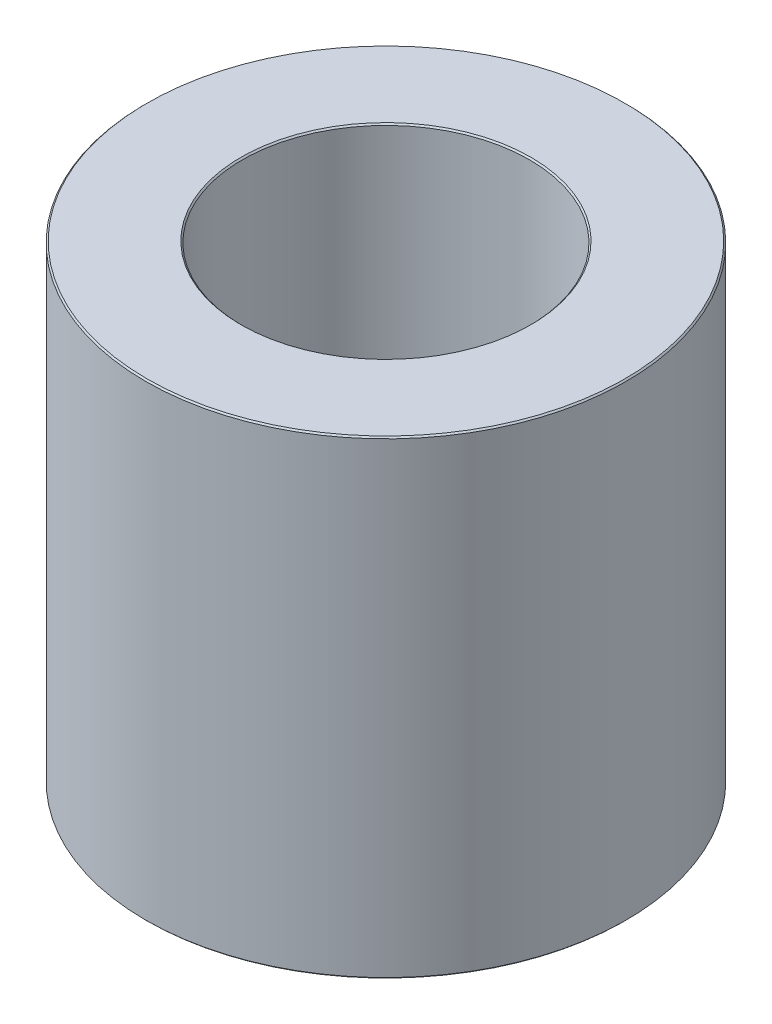
ISO-10303-21;
HEADER;
FILE_DESCRIPTION(('STEP AP214'),'2;1');
FILE_NAME('part.step','',(''),(''),'','','');
FILE_SCHEMA(('AUTOMOTIVE_DESIGN { 1 0 10303 214 1 1 1 1 }'));
ENDSEC;
DATA;
#1=APPLICATION_CONTEXT('core data for automotive mechanical design processes');
#2=APPLICATION_PROTOCOL_DEFINITION('international standard','automotive_design',2000,#1);
#3=PRODUCT_CONTEXT('',#1,'mechanical');
#4=PRODUCT('Part','Part','',(#3));
#5=PRODUCT_RELATED_PRODUCT_CATEGORY('part','',(#4));
#6=PRODUCT_DEFINITION_FORMATION('','',#4);
#7=PRODUCT_DEFINITION_CONTEXT('part definition',#1,'design');
#8=PRODUCT_DEFINITION('design','',#6,#7);
#9=PRODUCT_DEFINITION_SHAPE('','',#8);
#10=(LENGTH_UNIT() NAMED_UNIT(*) SI_UNIT(.MILLI.,.METRE.));
#11=(NAMED_UNIT(*) PLANE_ANGLE_UNIT() SI_UNIT($,.RADIAN.));
#12=(NAMED_UNIT(*) SI_UNIT($,.STERADIAN.) SOLID_ANGLE_UNIT());
#13=UNCERTAINTY_MEASURE_WITH_UNIT(LENGTH_MEASURE(1.E-05),#10,'distance_accuracy_value','');
#14=(GEOMETRIC_REPRESENTATION_CONTEXT(3) GLOBAL_UNCERTAINTY_ASSIGNED_CONTEXT((#13)) GLOBAL_UNIT_ASSIGNED_CONTEXT((#10,
#11,#12)) REPRESENTATION_CONTEXT('',''));
#15=CARTESIAN_POINT('',(0.,0.,0.));
#16=DIRECTION('',(0.,0.,1.));
#17=DIRECTION('',(1.,0.,0.));
#18=AXIS2_PLACEMENT_3D('',#15,#16,#17);
#19=CARTESIAN_POINT('',(0.,78.1450809046556,0.));
#20=DIRECTION('',(0.,-1.,0.));
#21=DIRECTION('',(0.,0.,-1.));
#22=AXIS2_PLACEMENT_3D('',#19,#20,#21);
#23=CYLINDRICAL_SURFACE('',#22,40.);
#24=CARTESIAN_POINT('',(0.,0.239085268171235,0.));
#25=DIRECTION('',(0.,1.,0.));
#26=DIRECTION('',(0.,0.,1.));
#27=AXIS2_PLACEMENT_3D('',#24,#25,#26);
#28=CIRCLE('',#27,40.);
#29=CARTESIAN_POINT('',(0.,0.239085268171235,40.));
#30=VERTEX_POINT('',#29);
#31=EDGE_CURVE('E10',#30,#30,#28,.T.);
#32=ORIENTED_EDGE('',*,*,#31,.T.);
#33=EDGE_LOOP('',(#32));
#34=FACE_BOUND('',#33,.T.);
#35=CARTESIAN_POINT('',(0.,77.9059956364843,0.));
#36=DIRECTION('',(0.,1.,0.));
#37=DIRECTION('',(0.,0.,1.));
#38=AXIS2_PLACEMENT_3D('',#35,#36,#37);
#39=CIRCLE('',#38,40.);
#40=CARTESIAN_POINT('',(0.,77.9059956364843,40.));
#41=VERTEX_POINT('',#40);
#42=EDGE_CURVE('E50',#41,#41,#39,.F.);
#43=ORIENTED_EDGE('',*,*,#42,.T.);
#44=EDGE_LOOP('',(#43));
#45=FACE_BOUND('',#44,.T.);
#46=ADVANCED_FACE('F39',(#34,#45),#23,.T.);
#47=CARTESIAN_POINT('',(0.,78.1450809046556,0.));
#48=DIRECTION('',(0.,1.,0.));
#49=DIRECTION('',(0.,0.,1.));
#50=AXIS2_PLACEMENT_3D('',#47,#48,#49);
#51=PLANE('',#50);
#52=CARTESIAN_POINT('',(0.,78.1450809046556,0.));
#53=DIRECTION('',(0.,1.,0.));
#54=DIRECTION('',(0.,0.,1.));
#55=AXIS2_PLACEMENT_3D('',#52,#53,#54);
#56=CIRCLE('',#55,24.1464319925768);
#57=CARTESIAN_POINT('',(0.,78.1450809046556,24.1464319925768));
#58=VERTEX_POINT('',#57);
#59=EDGE_CURVE('E58',#58,#58,#56,.F.);
#60=ORIENTED_EDGE('',*,*,#59,.T.);
#61=EDGE_LOOP('',(#60));
#62=FACE_BOUND('',#61,.T.);
#63=CARTESIAN_POINT('',(0.,78.1450809046556,0.));
#64=DIRECTION('',(0.,1.,0.));
#65=DIRECTION('',(0.,0.,1.));
#66=AXIS2_PLACEMENT_3D('',#63,#64,#65);
#67=CIRCLE('',#66,39.7609147318287);
#68=CARTESIAN_POINT('',(0.,78.1450809046556,39.7609147318287));
#69=VERTEX_POINT('',#68);
#70=EDGE_CURVE('E61',#69,#69,#67,.T.);
#71=ORIENTED_EDGE('',*,*,#70,.T.);
#72=EDGE_LOOP('',(#71));
#73=FACE_BOUND('',#72,.T.);
#74=ADVANCED_FACE('F88',(#62,#73),#51,.T.);
#75=CARTESIAN_POINT('',(0.,0.,0.));
#76=DIRECTION('',(0.,1.,0.));
#77=DIRECTION('',(0.,0.,1.));
#78=AXIS2_PLACEMENT_3D('',#75,#76,#77);
#79=PLANE('',#78);
#80=CARTESIAN_POINT('',(0.,0.,0.));
#81=DIRECTION('',(0.,1.,0.));
#82=DIRECTION('',(0.,0.,1.));
#83=AXIS2_PLACEMENT_3D('',#80,#81,#82);
#84=CIRCLE('',#83,24.1464319925769);
#85=CARTESIAN_POINT('',(0.,0.,24.1464319925769));
#86=VERTEX_POINT('',#85);
#87=EDGE_CURVE('E51',#86,#86,#84,.T.);
#88=ORIENTED_EDGE('',*,*,#87,.T.);
#89=EDGE_LOOP('',(#88));
#90=FACE_BOUND('',#89,.T.);
#91=CARTESIAN_POINT('',(0.,0.,0.));
#92=DIRECTION('',(0.,1.,0.));
#93=DIRECTION('',(0.,0.,1.));
#94=AXIS2_PLACEMENT_3D('',#91,#92,#93);
#95=CIRCLE('',#94,39.7609147318288);
#96=CARTESIAN_POINT('',(0.,0.,39.7609147318288));
#97=VERTEX_POINT('',#96);
#98=EDGE_CURVE('E54',#97,#97,#95,.F.);
#99=ORIENTED_EDGE('',*,*,#98,.T.);
#100=EDGE_LOOP('',(#99));
#101=FACE_BOUND('',#100,.T.);
#102=ADVANCED_FACE('F83',(#90,#101),#79,.F.);
#103=CARTESIAN_POINT('',(0.,78.1450809046556,0.));
#104=DIRECTION('',(0.,-1.,0.));
#105=DIRECTION('',(0.,0.,-1.));
#106=AXIS2_PLACEMENT_3D('',#103,#104,#105);
#107=CYLINDRICAL_SURFACE('',#106,23.9073467244056);
#108=CARTESIAN_POINT('',(0.,77.9059956364844,0.));
#109=DIRECTION('',(0.,1.,0.));
#110=DIRECTION('',(0.,0.,1.));
#111=AXIS2_PLACEMENT_3D('',#108,#109,#110);
#112=CIRCLE('',#111,23.9073467244056);
#113=CARTESIAN_POINT('',(0.,77.9059956364844,23.9073467244056));
#114=VERTEX_POINT('',#113);
#115=EDGE_CURVE('E67',#114,#114,#112,.T.);
#116=ORIENTED_EDGE('',*,*,#115,.T.);
#117=EDGE_LOOP('',(#116));
#118=FACE_BOUND('',#117,.T.);
#119=CARTESIAN_POINT('',(0.,0.239085268171235,0.));
#120=DIRECTION('',(0.,1.,0.));
#121=DIRECTION('',(0.,0.,1.));
#122=AXIS2_PLACEMENT_3D('',#119,#120,#121);
#123=CIRCLE('',#122,23.9073467244056);
#124=CARTESIAN_POINT('',(0.,0.239085268171235,23.9073467244056));
#125=VERTEX_POINT('',#124);
#126=EDGE_CURVE('E69',#125,#125,#123,.F.);
#127=ORIENTED_EDGE('',*,*,#126,.T.);
#128=EDGE_LOOP('',(#127));
#129=FACE_BOUND('',#128,.T.);
#130=ADVANCED_FACE('F71',(#118,#129),#107,.F.);
#131=CARTESIAN_POINT('',(0.,77.9059956364844,0.));
#132=DIRECTION('',(0.,1.,0.));
#133=DIRECTION('',(0.,0.,1.));
#134=AXIS2_PLACEMENT_3D('',#131,#132,#133);
#135=CONICAL_SURFACE('',#134,23.9073467244056,0.785398163397448);
#136=ORIENTED_EDGE('',*,*,#59,.F.);
#137=EDGE_LOOP('',(#136));
#138=FACE_BOUND('',#137,.T.);
#139=ORIENTED_EDGE('',*,*,#115,.F.);
#140=EDGE_LOOP('',(#139));
#141=FACE_BOUND('',#140,.T.);
#142=ADVANCED_FACE('F77',(#138,#141),#135,.F.);
#143=CARTESIAN_POINT('',(0.,0.,0.));
#144=DIRECTION('',(0.,-1.,0.));
#145=DIRECTION('',(0.,0.,-1.));
#146=AXIS2_PLACEMENT_3D('',#143,#144,#145);
#147=CONICAL_SURFACE('',#146,24.1464319925769,0.785398163397448);
#148=ORIENTED_EDGE('',*,*,#126,.F.);
#149=EDGE_LOOP('',(#148));
#150=FACE_BOUND('',#149,.T.);
#151=ORIENTED_EDGE('',*,*,#87,.F.);
#152=EDGE_LOOP('',(#151));
#153=FACE_BOUND('',#152,.T.);
#154=ADVANCED_FACE('F73',(#150,#153),#147,.F.);
#155=CARTESIAN_POINT('',(0.,0.239085268171235,0.));
#156=DIRECTION('',(0.,1.,0.));
#157=DIRECTION('',(0.,0.,1.));
#158=AXIS2_PLACEMENT_3D('',#155,#156,#157);
#159=CONICAL_SURFACE('',#158,40.,0.785398163397434);
#160=ORIENTED_EDGE('',*,*,#98,.F.);
#161=EDGE_LOOP('',(#160));
#162=FACE_BOUND('',#161,.T.);
#163=ORIENTED_EDGE('',*,*,#31,.F.);
#164=EDGE_LOOP('',(#163));
#165=FACE_BOUND('',#164,.T.);
#166=ADVANCED_FACE('F76',(#162,#165),#159,.T.);
#167=CARTESIAN_POINT('',(0.,78.1450809046556,0.));
#168=DIRECTION('',(0.,-1.,0.));
#169=DIRECTION('',(0.,0.,-1.));
#170=AXIS2_PLACEMENT_3D('',#167,#168,#169);
#171=CONICAL_SURFACE('',#170,39.7609147318287,0.785398163397463);
#172=ORIENTED_EDGE('',*,*,#42,.F.);
#173=EDGE_LOOP('',(#172));
#174=FACE_BOUND('',#173,.T.);
#175=ORIENTED_EDGE('',*,*,#70,.F.);
#176=EDGE_LOOP('',(#175));
#177=FACE_BOUND('',#176,.T.);
#178=ADVANCED_FACE('F45',(#174,#177),#171,.T.);
#179=CLOSED_SHELL('',(#46,#74,#102,#130,#142,#154,#166,#178));
#180=MANIFOLD_SOLID_BREP('B2',#179);
#181=ADVANCED_BREP_SHAPE_REPRESENTATION('',(#18,#180),#14);
#182=SHAPE_DEFINITION_REPRESENTATION(#9,#181);
ENDSEC;
END-ISO-10303-21;
